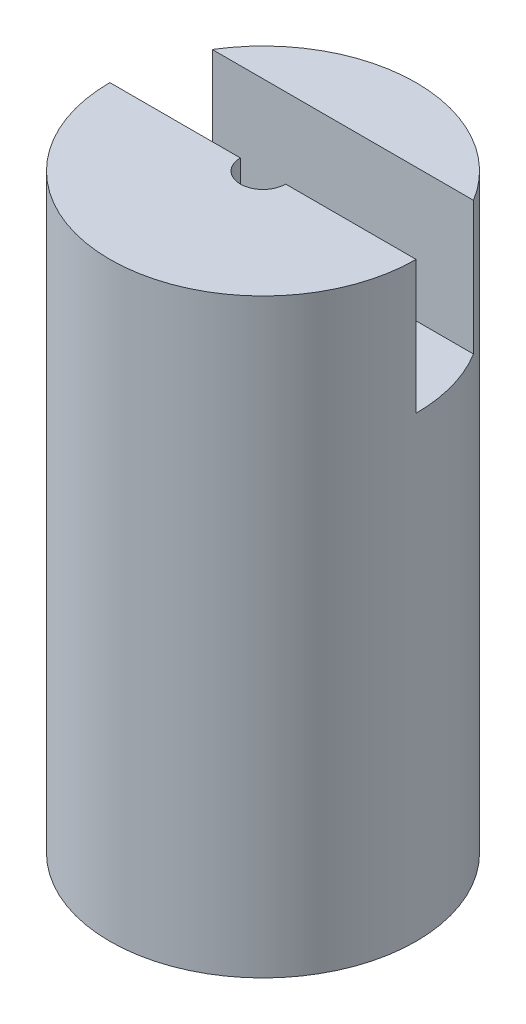
ISO-10303-21;
HEADER;
FILE_DESCRIPTION(('STEP AP214'),'2;1');
FILE_NAME('part.step','',(''),(''),'','','');
FILE_SCHEMA(('AUTOMOTIVE_DESIGN { 1 0 10303 214 1 1 1 1 }'));
ENDSEC;
DATA;
#1=APPLICATION_CONTEXT('core data for automotive mechanical design processes');
#2=APPLICATION_PROTOCOL_DEFINITION('international standard','automotive_design',2000,#1);
#3=PRODUCT_CONTEXT('',#1,'mechanical');
#4=PRODUCT('Part','Part','',(#3));
#5=PRODUCT_RELATED_PRODUCT_CATEGORY('part','',(#4));
#6=PRODUCT_DEFINITION_FORMATION('','',#4);
#7=PRODUCT_DEFINITION_CONTEXT('part definition',#1,'design');
#8=PRODUCT_DEFINITION('design','',#6,#7);
#9=PRODUCT_DEFINITION_SHAPE('','',#8);
#10=(LENGTH_UNIT() NAMED_UNIT(*) SI_UNIT(.MILLI.,.METRE.));
#11=(NAMED_UNIT(*) PLANE_ANGLE_UNIT() SI_UNIT($,.RADIAN.));
#12=(NAMED_UNIT(*) SI_UNIT($,.STERADIAN.) SOLID_ANGLE_UNIT());
#13=UNCERTAINTY_MEASURE_WITH_UNIT(LENGTH_MEASURE(1.E-05),#10,'distance_accuracy_value','');
#14=(GEOMETRIC_REPRESENTATION_CONTEXT(3) GLOBAL_UNCERTAINTY_ASSIGNED_CONTEXT((#13)) GLOBAL_UNIT_ASSIGNED_CONTEXT((#10,
#11,#12)) REPRESENTATION_CONTEXT('',''));
#15=CARTESIAN_POINT('',(0.,0.,0.));
#16=DIRECTION('',(0.,0.,1.));
#17=DIRECTION('',(1.,0.,0.));
#18=AXIS2_PLACEMENT_3D('',#15,#16,#17);
#19=CARTESIAN_POINT('',(0.,65.3401788431079,-17.25));
#20=DIRECTION('',(0.,-1.,0.));
#21=DIRECTION('',(0.,0.,-1.));
#22=AXIS2_PLACEMENT_3D('',#19,#20,#21);
#23=PLANE('',#22);
#24=DIRECTION('',(-1.,0.,0.));
#25=VECTOR('',#24,1.);
#26=CARTESIAN_POINT('',(0.,65.3401788431079,-9.));
#27=LINE('',#26,#25);
#28=CARTESIAN_POINT('',(14.7160626527614,65.3401788431079,-9.));
#29=VERTEX_POINT('',#28);
#30=CARTESIAN_POINT('',(-14.7160626527614,65.3401788431079,-9.));
#31=VERTEX_POINT('',#30);
#32=EDGE_CURVE('E139',#29,#31,#27,.T.);
#33=ORIENTED_EDGE('',*,*,#32,.F.);
#34=CARTESIAN_POINT('',(0.,65.3401788431079,0.));
#35=DIRECTION('',(0.,1.,0.));
#36=DIRECTION('',(0.,0.,1.));
#37=AXIS2_PLACEMENT_3D('',#34,#35,#36);
#38=CIRCLE('',#37,17.25);
#39=EDGE_CURVE('E118',#29,#31,#38,.T.);
#40=ORIENTED_EDGE('',*,*,#39,.T.);
#41=EDGE_LOOP('',(#33,#40));
#42=FACE_BOUND('',#41,.T.);
#43=ADVANCED_FACE('F37',(#42),#23,.F.);
#44=CARTESIAN_POINT('',(0.,93.4641096161456,0.));
#45=DIRECTION('',(0.,1.,0.));
#46=DIRECTION('',(0.,0.,1.));
#47=AXIS2_PLACEMENT_3D('',#44,#45,#46);
#48=CYLINDRICAL_SURFACE('',#47,17.25);
#49=CARTESIAN_POINT('',(0.,-1.1917099586758,0.));
#50=DIRECTION('',(0.,1.,0.));
#51=DIRECTION('',(0.,0.,1.));
#52=AXIS2_PLACEMENT_3D('',#49,#50,#51);
#53=CIRCLE('',#52,17.25);
#54=CARTESIAN_POINT('',(0.,-1.1917099586758,17.25));
#55=VERTEX_POINT('',#54);
#56=EDGE_CURVE('E144',#55,#55,#53,.T.);
#57=ORIENTED_EDGE('',*,*,#56,.T.);
#58=EDGE_LOOP('',(#57));
#59=FACE_BOUND('',#58,.T.);
#60=DIRECTION('',(0.,1.,0.));
#61=VECTOR('',#60,1.);
#62=CARTESIAN_POINT('',(14.7160626527614,93.4641096161456,-9.));
#63=LINE('',#62,#61);
#64=CARTESIAN_POINT('',(14.7160626527614,50.3401788431079,-9.));
#65=VERTEX_POINT('',#64);
#66=EDGE_CURVE('E11',#65,#29,#63,.T.);
#67=ORIENTED_EDGE('',*,*,#66,.F.);
#68=CARTESIAN_POINT('',(0.,50.3401788431079,0.));
#69=DIRECTION('',(0.,-1.,0.));
#70=DIRECTION('',(0.,0.,-1.));
#71=AXIS2_PLACEMENT_3D('',#68,#69,#70);
#72=CIRCLE('',#71,17.25);
#73=CARTESIAN_POINT('',(17.25,50.3401788431079,0.));
#74=VERTEX_POINT('',#73);
#75=EDGE_CURVE('E45',#65,#74,#72,.T.);
#76=ORIENTED_EDGE('',*,*,#75,.T.);
#77=DIRECTION('',(0.,1.,0.));
#78=VECTOR('',#77,1.);
#79=CARTESIAN_POINT('',(17.25,93.4641096161456,0.));
#80=LINE('',#79,#78);
#81=CARTESIAN_POINT('',(17.25,65.3401788431079,0.));
#82=VERTEX_POINT('',#81);
#83=EDGE_CURVE('E125',#74,#82,#80,.T.);
#84=ORIENTED_EDGE('',*,*,#83,.T.);
#85=CARTESIAN_POINT('',(-17.25,65.3401788431079,0.));
#86=VERTEX_POINT('',#85);
#87=EDGE_CURVE('E146',#86,#82,#38,.T.);
#88=ORIENTED_EDGE('',*,*,#87,.F.);
#89=DIRECTION('',(0.,1.,0.));
#90=VECTOR('',#89,1.);
#91=CARTESIAN_POINT('',(-17.25,93.4641096161456,0.));
#92=LINE('',#91,#90);
#93=CARTESIAN_POINT('',(-17.25,50.3401788431079,0.));
#94=VERTEX_POINT('',#93);
#95=EDGE_CURVE('E116',#86,#94,#92,.F.);
#96=ORIENTED_EDGE('',*,*,#95,.T.);
#97=CARTESIAN_POINT('',(-14.7160626527614,50.3401788431079,-9.));
#98=VERTEX_POINT('',#97);
#99=EDGE_CURVE('E104',#94,#98,#72,.T.);
#100=ORIENTED_EDGE('',*,*,#99,.T.);
#101=DIRECTION('',(0.,1.,0.));
#102=VECTOR('',#101,1.);
#103=CARTESIAN_POINT('',(-14.7160626527614,93.4641096161456,-9.));
#104=LINE('',#103,#102);
#105=EDGE_CURVE('E124',#31,#98,#104,.F.);
#106=ORIENTED_EDGE('',*,*,#105,.F.);
#107=ORIENTED_EDGE('',*,*,#39,.F.);
#108=EDGE_LOOP('',(#67,#76,#84,#88,#96,#100,#106,#107));
#109=FACE_BOUND('',#108,.T.);
#110=ADVANCED_FACE('F131',(#59,#109),#48,.T.);
#111=CARTESIAN_POINT('',(0.,93.4641096161456,0.));
#112=DIRECTION('',(0.,1.,0.));
#113=DIRECTION('',(0.,0.,1.));
#114=AXIS2_PLACEMENT_3D('',#111,#112,#113);
#115=CYLINDRICAL_SURFACE('',#114,2.25);
#116=CARTESIAN_POINT('',(0.,26.3878633706786,0.));
#117=DIRECTION('',(0.,1.,0.));
#118=DIRECTION('',(0.,0.,1.));
#119=AXIS2_PLACEMENT_3D('',#116,#117,#118);
#120=CIRCLE('',#119,2.25);
#121=CARTESIAN_POINT('',(0.,26.3878633706786,2.25));
#122=VERTEX_POINT('',#121);
#123=EDGE_CURVE('E141',#122,#122,#120,.T.);
#124=ORIENTED_EDGE('',*,*,#123,.F.);
#125=EDGE_LOOP('',(#124));
#126=FACE_BOUND('',#125,.T.);
#127=CARTESIAN_POINT('',(0.,50.3401788431079,0.));
#128=DIRECTION('',(0.,1.,0.));
#129=DIRECTION('',(0.,0.,1.));
#130=AXIS2_PLACEMENT_3D('',#127,#128,#129);
#131=CIRCLE('',#130,2.25);
#132=CARTESIAN_POINT('',(0.,50.3401788431079,2.25));
#133=VERTEX_POINT('',#132);
#134=EDGE_CURVE('E112',#133,#133,#131,.T.);
#135=ORIENTED_EDGE('',*,*,#134,.T.);
#136=EDGE_LOOP('',(#135));
#137=FACE_BOUND('',#136,.T.);
#138=ADVANCED_FACE('F39',(#126,#137),#115,.F.);
#139=CARTESIAN_POINT('',(0.,50.3401788431079,-2.25));
#140=DIRECTION('',(0.,-1.,0.));
#141=DIRECTION('',(0.,0.,-1.));
#142=AXIS2_PLACEMENT_3D('',#139,#140,#141);
#143=PLANE('',#142);
#144=ORIENTED_EDGE('',*,*,#134,.F.);
#145=EDGE_LOOP('',(#144));
#146=FACE_BOUND('',#145,.T.);
#147=CARTESIAN_POINT('',(0.,50.3401788431079,0.));
#148=DIRECTION('',(0.,1.,0.));
#149=DIRECTION('',(0.,0.,1.));
#150=AXIS2_PLACEMENT_3D('',#147,#148,#149);
#151=CIRCLE('',#150,2.55);
#152=CARTESIAN_POINT('',(-2.55,50.3401788431079,0.));
#153=VERTEX_POINT('',#152);
#154=CARTESIAN_POINT('',(2.55,50.3401788431079,0.));
#155=VERTEX_POINT('',#154);
#156=EDGE_CURVE('E101',#153,#155,#151,.T.);
#157=ORIENTED_EDGE('',*,*,#156,.T.);
#158=DIRECTION('',(1.,0.,0.));
#159=VECTOR('',#158,1.);
#160=CARTESIAN_POINT('',(-21.8122101770685,50.3401788431079,0.));
#161=LINE('',#160,#159);
#162=EDGE_CURVE('E107',#155,#74,#161,.T.);
#163=ORIENTED_EDGE('',*,*,#162,.T.);
#164=ORIENTED_EDGE('',*,*,#75,.F.);
#165=DIRECTION('',(1.,0.,0.));
#166=VECTOR('',#165,1.);
#167=CARTESIAN_POINT('',(-21.8122101770685,50.3401788431079,-9.));
#168=LINE('',#167,#166);
#169=EDGE_CURVE('E106',#98,#65,#168,.T.);
#170=ORIENTED_EDGE('',*,*,#169,.F.);
#171=ORIENTED_EDGE('',*,*,#99,.F.);
#172=EDGE_CURVE('E52',#94,#153,#161,.T.);
#173=ORIENTED_EDGE('',*,*,#172,.T.);
#174=EDGE_LOOP('',(#157,#163,#164,#170,#171,#173));
#175=FACE_BOUND('',#174,.T.);
#176=ADVANCED_FACE('F99',(#146,#175),#143,.F.);
#177=CARTESIAN_POINT('',(0.,93.4641096161456,0.));
#178=DIRECTION('',(0.,1.,0.));
#179=DIRECTION('',(0.,0.,1.));
#180=AXIS2_PLACEMENT_3D('',#177,#178,#179);
#181=CYLINDRICAL_SURFACE('',#180,2.55);
#182=CARTESIAN_POINT('',(0.,65.3401788431079,0.));
#183=DIRECTION('',(0.,1.,0.));
#184=DIRECTION('',(0.,0.,1.));
#185=AXIS2_PLACEMENT_3D('',#182,#183,#184);
#186=CIRCLE('',#185,2.55);
#187=CARTESIAN_POINT('',(-2.55,65.3401788431079,0.));
#188=VERTEX_POINT('',#187);
#189=CARTESIAN_POINT('',(2.55,65.3401788431079,0.));
#190=VERTEX_POINT('',#189);
#191=EDGE_CURVE('E113',#188,#190,#186,.T.);
#192=ORIENTED_EDGE('',*,*,#191,.T.);
#193=DIRECTION('',(0.,1.,0.));
#194=VECTOR('',#193,1.);
#195=CARTESIAN_POINT('',(2.55,93.4641096161456,0.));
#196=LINE('',#195,#194);
#197=EDGE_CURVE('E111',#190,#155,#196,.F.);
#198=ORIENTED_EDGE('',*,*,#197,.T.);
#199=ORIENTED_EDGE('',*,*,#156,.F.);
#200=DIRECTION('',(0.,1.,0.));
#201=VECTOR('',#200,1.);
#202=CARTESIAN_POINT('',(-2.55,93.4641096161456,0.));
#203=LINE('',#202,#201);
#204=EDGE_CURVE('E87',#153,#188,#203,.T.);
#205=ORIENTED_EDGE('',*,*,#204,.T.);
#206=EDGE_LOOP('',(#192,#198,#199,#205));
#207=FACE_BOUND('',#206,.T.);
#208=ADVANCED_FACE('F110',(#207),#181,.F.);
#209=ORIENTED_EDGE('',*,*,#87,.T.);
#210=DIRECTION('',(-1.,0.,0.));
#211=VECTOR('',#210,1.);
#212=CARTESIAN_POINT('',(0.,65.3401788431079,0.));
#213=LINE('',#212,#211);
#214=EDGE_CURVE('E95',#82,#190,#213,.T.);
#215=ORIENTED_EDGE('',*,*,#214,.T.);
#216=ORIENTED_EDGE('',*,*,#191,.F.);
#217=EDGE_CURVE('E90',#188,#86,#213,.T.);
#218=ORIENTED_EDGE('',*,*,#217,.T.);
#219=EDGE_LOOP('',(#209,#215,#216,#218));
#220=FACE_BOUND('',#219,.T.);
#221=ADVANCED_FACE('F151',(#220),#23,.F.);
#222=CARTESIAN_POINT('',(0.,-1.1917099586758,0.));
#223=DIRECTION('',(0.,1.,0.));
#224=DIRECTION('',(0.,0.,1.));
#225=AXIS2_PLACEMENT_3D('',#222,#223,#224);
#226=PLANE('',#225);
#227=ORIENTED_EDGE('',*,*,#56,.F.);
#228=EDGE_LOOP('',(#227));
#229=FACE_BOUND('',#228,.T.);
#230=ADVANCED_FACE('F172',(#229),#226,.F.);
#231=CARTESIAN_POINT('',(0.,26.3878633706786,-2.25));
#232=DIRECTION('',(0.,-1.,0.));
#233=DIRECTION('',(0.,0.,-1.));
#234=AXIS2_PLACEMENT_3D('',#231,#232,#233);
#235=PLANE('',#234);
#236=ORIENTED_EDGE('',*,*,#123,.T.);
#237=EDGE_LOOP('',(#236));
#238=FACE_BOUND('',#237,.T.);
#239=ADVANCED_FACE('F160',(#238),#235,.F.);
#240=CARTESIAN_POINT('',(0.,0.,-9.));
#241=DIRECTION('',(0.,0.,1.));
#242=DIRECTION('',(1.,0.,0.));
#243=AXIS2_PLACEMENT_3D('',#240,#241,#242);
#244=PLANE('',#243);
#245=ORIENTED_EDGE('',*,*,#66,.T.);
#246=ORIENTED_EDGE('',*,*,#32,.T.);
#247=ORIENTED_EDGE('',*,*,#105,.T.);
#248=ORIENTED_EDGE('',*,*,#169,.T.);
#249=EDGE_LOOP('',(#245,#246,#247,#248));
#250=FACE_BOUND('',#249,.T.);
#251=ADVANCED_FACE('F133',(#250),#244,.T.);
#252=CARTESIAN_POINT('',(0.,0.,0.));
#253=DIRECTION('',(0.,0.,1.));
#254=DIRECTION('',(1.,0.,0.));
#255=AXIS2_PLACEMENT_3D('',#252,#253,#254);
#256=PLANE('',#255);
#257=ORIENTED_EDGE('',*,*,#214,.F.);
#258=ORIENTED_EDGE('',*,*,#83,.F.);
#259=ORIENTED_EDGE('',*,*,#162,.F.);
#260=ORIENTED_EDGE('',*,*,#197,.F.);
#261=EDGE_LOOP('',(#257,#258,#259,#260));
#262=FACE_BOUND('',#261,.T.);
#263=ADVANCED_FACE('F153',(#262),#256,.F.);
#264=ORIENTED_EDGE('',*,*,#172,.F.);
#265=ORIENTED_EDGE('',*,*,#95,.F.);
#266=ORIENTED_EDGE('',*,*,#217,.F.);
#267=ORIENTED_EDGE('',*,*,#204,.F.);
#268=EDGE_LOOP('',(#264,#265,#266,#267));
#269=FACE_BOUND('',#268,.T.);
#270=ADVANCED_FACE('F88',(#269),#256,.F.);
#271=CLOSED_SHELL('',(#43,#110,#138,#176,#208,#221,#230,#239,#251,#263,#270));
#272=MANIFOLD_SOLID_BREP('B2',#271);
#273=ADVANCED_BREP_SHAPE_REPRESENTATION('',(#18,#272),#14);
#274=SHAPE_DEFINITION_REPRESENTATION(#9,#273);
ENDSEC;
END-ISO-10303-21;
